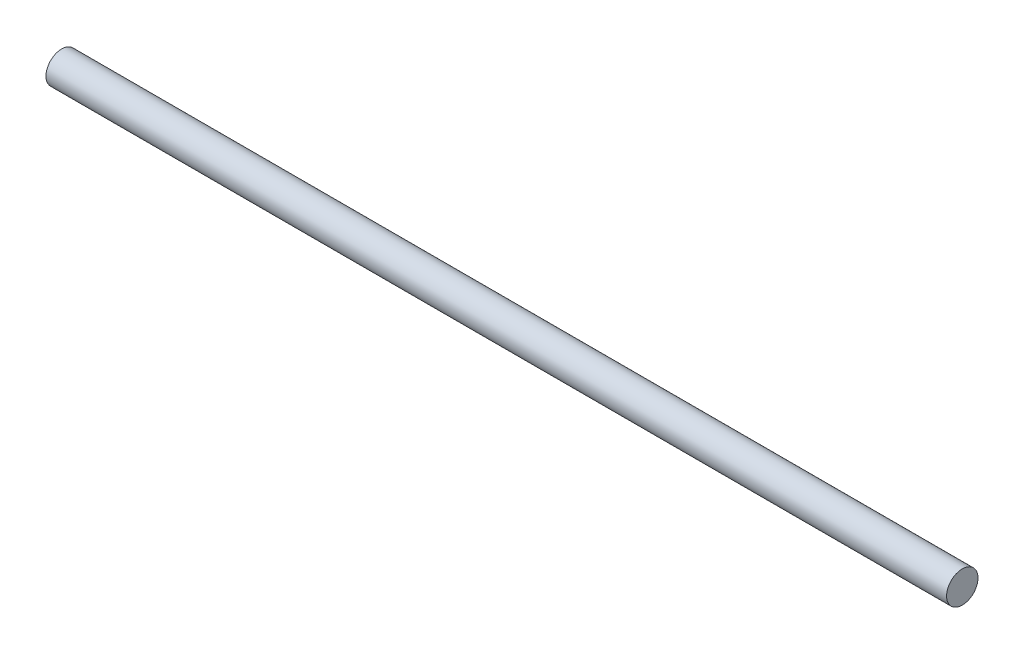
ISO-10303-21;
HEADER;
FILE_DESCRIPTION(('STEP AP214'),'2;1');
FILE_NAME('part.step','',(''),(''),'','','');
FILE_SCHEMA(('AUTOMOTIVE_DESIGN { 1 0 10303 214 1 1 1 1 }'));
ENDSEC;
DATA;
#1=APPLICATION_CONTEXT('core data for automotive mechanical design processes');
#2=APPLICATION_PROTOCOL_DEFINITION('international standard','automotive_design',2000,#1);
#3=PRODUCT_CONTEXT('',#1,'mechanical');
#4=PRODUCT('Part','Part','',(#3));
#5=PRODUCT_RELATED_PRODUCT_CATEGORY('part','',(#4));
#6=PRODUCT_DEFINITION_FORMATION('','',#4);
#7=PRODUCT_DEFINITION_CONTEXT('part definition',#1,'design');
#8=PRODUCT_DEFINITION('design','',#6,#7);
#9=PRODUCT_DEFINITION_SHAPE('','',#8);
#10=(LENGTH_UNIT() NAMED_UNIT(*) SI_UNIT(.MILLI.,.METRE.));
#11=(NAMED_UNIT(*) PLANE_ANGLE_UNIT() SI_UNIT($,.RADIAN.));
#12=(NAMED_UNIT(*) SI_UNIT($,.STERADIAN.) SOLID_ANGLE_UNIT());
#13=UNCERTAINTY_MEASURE_WITH_UNIT(LENGTH_MEASURE(1.E-05),#10,'distance_accuracy_value','');
#14=(GEOMETRIC_REPRESENTATION_CONTEXT(3) GLOBAL_UNCERTAINTY_ASSIGNED_CONTEXT((#13)) GLOBAL_UNIT_ASSIGNED_CONTEXT((#10,
#11,#12)) REPRESENTATION_CONTEXT('',''));
#15=CARTESIAN_POINT('',(0.,0.,0.));
#16=DIRECTION('',(0.,0.,1.));
#17=DIRECTION('',(1.,0.,0.));
#18=AXIS2_PLACEMENT_3D('',#15,#16,#17);
#19=CARTESIAN_POINT('',(143.3,0.,0.));
#20=DIRECTION('',(-1.,0.,0.));
#21=DIRECTION('',(0.,0.,1.));
#22=AXIS2_PLACEMENT_3D('',#19,#20,#21);
#23=CYLINDRICAL_SURFACE('',#22,5.);
#24=CARTESIAN_POINT('',(143.3,0.,0.));
#25=DIRECTION('',(1.,0.,0.));
#26=DIRECTION('',(0.,0.,-1.));
#27=AXIS2_PLACEMENT_3D('',#24,#25,#26);
#28=CIRCLE('',#27,5.);
#29=CARTESIAN_POINT('',(143.3,0.,-5.));
#30=VERTEX_POINT('',#29);
#31=EDGE_CURVE('E10',#30,#30,#28,.T.);
#32=ORIENTED_EDGE('',*,*,#31,.F.);
#33=EDGE_LOOP('',(#32));
#34=FACE_BOUND('',#33,.T.);
#35=CARTESIAN_POINT('',(-143.3,0.,0.));
#36=DIRECTION('',(1.,0.,0.));
#37=DIRECTION('',(0.,0.,-1.));
#38=AXIS2_PLACEMENT_3D('',#35,#36,#37);
#39=CIRCLE('',#38,5.);
#40=CARTESIAN_POINT('',(-143.3,0.,-5.));
#41=VERTEX_POINT('',#40);
#42=EDGE_CURVE('E40',#41,#41,#39,.T.);
#43=ORIENTED_EDGE('',*,*,#42,.T.);
#44=EDGE_LOOP('',(#43));
#45=FACE_BOUND('',#44,.T.);
#46=ADVANCED_FACE('F37',(#34,#45),#23,.T.);
#47=CARTESIAN_POINT('',(143.3,0.,0.));
#48=DIRECTION('',(1.,0.,0.));
#49=DIRECTION('',(0.,0.,-1.));
#50=AXIS2_PLACEMENT_3D('',#47,#48,#49);
#51=PLANE('',#50);
#52=ORIENTED_EDGE('',*,*,#31,.T.);
#53=EDGE_LOOP('',(#52));
#54=FACE_BOUND('',#53,.T.);
#55=ADVANCED_FACE('F54',(#54),#51,.T.);
#56=CARTESIAN_POINT('',(-143.3,0.,0.));
#57=DIRECTION('',(1.,0.,0.));
#58=DIRECTION('',(0.,0.,-1.));
#59=AXIS2_PLACEMENT_3D('',#56,#57,#58);
#60=PLANE('',#59);
#61=ORIENTED_EDGE('',*,*,#42,.F.);
#62=EDGE_LOOP('',(#61));
#63=FACE_BOUND('',#62,.T.);
#64=ADVANCED_FACE('F52',(#63),#60,.F.);
#65=CLOSED_SHELL('',(#46,#55,#64));
#66=MANIFOLD_SOLID_BREP('B2',#65);
#67=ADVANCED_BREP_SHAPE_REPRESENTATION('',(#18,#66),#14);
#68=SHAPE_DEFINITION_REPRESENTATION(#9,#67);
ENDSEC;
END-ISO-10303-21;
